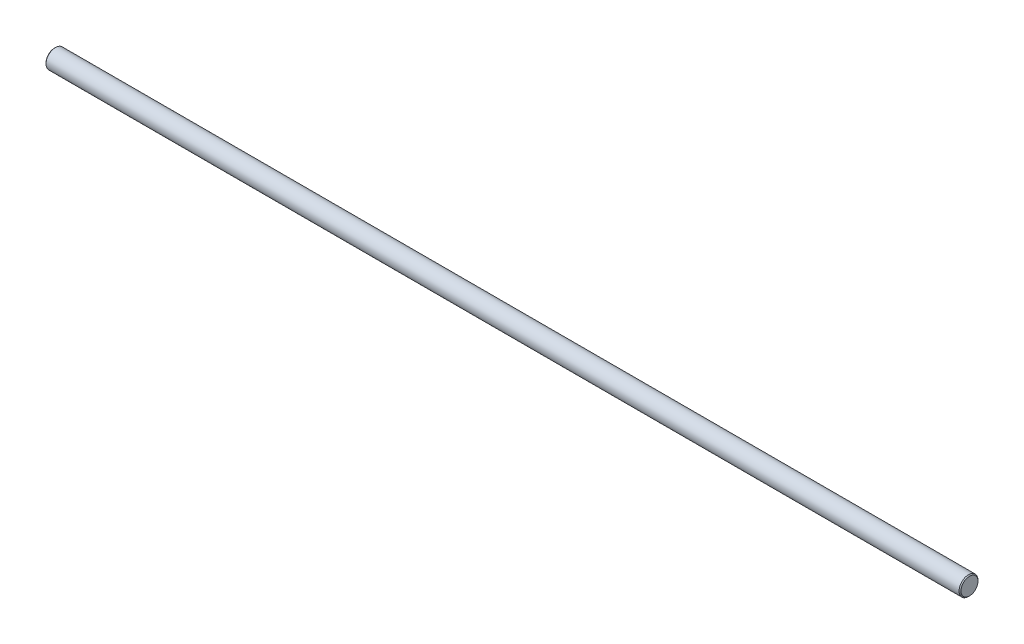
ISO-10303-21;
HEADER;
FILE_DESCRIPTION(('STEP AP214'),'2;1');
FILE_NAME('part.step','',(''),(''),'','','');
FILE_SCHEMA(('AUTOMOTIVE_DESIGN { 1 0 10303 214 1 1 1 1 }'));
ENDSEC;
DATA;
#1=APPLICATION_CONTEXT('core data for automotive mechanical design processes');
#2=APPLICATION_PROTOCOL_DEFINITION('international standard','automotive_design',2000,#1);
#3=PRODUCT_CONTEXT('',#1,'mechanical');
#4=PRODUCT('Part','Part','',(#3));
#5=PRODUCT_RELATED_PRODUCT_CATEGORY('part','',(#4));
#6=PRODUCT_DEFINITION_FORMATION('','',#4);
#7=PRODUCT_DEFINITION_CONTEXT('part definition',#1,'design');
#8=PRODUCT_DEFINITION('design','',#6,#7);
#9=PRODUCT_DEFINITION_SHAPE('','',#8);
#10=(LENGTH_UNIT() NAMED_UNIT(*) SI_UNIT(.MILLI.,.METRE.));
#11=(NAMED_UNIT(*) PLANE_ANGLE_UNIT() SI_UNIT($,.RADIAN.));
#12=(NAMED_UNIT(*) SI_UNIT($,.STERADIAN.) SOLID_ANGLE_UNIT());
#13=UNCERTAINTY_MEASURE_WITH_UNIT(LENGTH_MEASURE(1.E-05),#10,'distance_accuracy_value','');
#14=(GEOMETRIC_REPRESENTATION_CONTEXT(3) GLOBAL_UNCERTAINTY_ASSIGNED_CONTEXT((#13)) GLOBAL_UNIT_ASSIGNED_CONTEXT((#10,
#11,#12)) REPRESENTATION_CONTEXT('',''));
#15=CARTESIAN_POINT('',(0.,0.,0.));
#16=DIRECTION('',(0.,0.,1.));
#17=DIRECTION('',(1.,0.,0.));
#18=AXIS2_PLACEMENT_3D('',#15,#16,#17);
#19=CARTESIAN_POINT('',(0.,0.,0.));
#20=DIRECTION('',(1.,0.,0.));
#21=DIRECTION('',(0.,1.,0.));
#22=AXIS2_PLACEMENT_3D('',#19,#20,#21);
#23=PLANE('',#22);
#24=CARTESIAN_POINT('',(0.,0.,0.));
#25=DIRECTION('',(-1.,0.,0.));
#26=DIRECTION('',(0.,-1.,0.));
#27=AXIS2_PLACEMENT_3D('',#24,#25,#26);
#28=CIRCLE('',#27,4.5);
#29=CARTESIAN_POINT('',(0.,-4.5,0.));
#30=VERTEX_POINT('',#29);
#31=EDGE_CURVE('E10',#30,#30,#28,.T.);
#32=ORIENTED_EDGE('',*,*,#31,.T.);
#33=EDGE_LOOP('',(#32));
#34=FACE_BOUND('',#33,.T.);
#35=ADVANCED_FACE('F31',(#34),#23,.F.);
#36=CARTESIAN_POINT('',(0.5,0.,0.));
#37=DIRECTION('',(1.,0.,0.));
#38=DIRECTION('',(0.,1.,0.));
#39=AXIS2_PLACEMENT_3D('',#36,#37,#38);
#40=CONICAL_SURFACE('',#39,5.,0.785398163397447);
#41=ORIENTED_EDGE('',*,*,#31,.F.);
#42=EDGE_LOOP('',(#41));
#43=FACE_BOUND('',#42,.T.);
#44=CARTESIAN_POINT('',(0.5,0.,0.));
#45=DIRECTION('',(-1.,0.,0.));
#46=DIRECTION('',(0.,-1.,0.));
#47=AXIS2_PLACEMENT_3D('',#44,#45,#46);
#48=CIRCLE('',#47,5.);
#49=CARTESIAN_POINT('',(0.5,-5.,0.));
#50=VERTEX_POINT('',#49);
#51=EDGE_CURVE('E37',#50,#50,#48,.T.);
#52=ORIENTED_EDGE('',*,*,#51,.T.);
#53=EDGE_LOOP('',(#52));
#54=FACE_BOUND('',#53,.T.);
#55=ADVANCED_FACE('F63',(#43,#54),#40,.T.);
#56=CARTESIAN_POINT('',(483.,0.,0.));
#57=DIRECTION('',(-1.,0.,0.));
#58=DIRECTION('',(0.,-1.,0.));
#59=AXIS2_PLACEMENT_3D('',#56,#57,#58);
#60=CYLINDRICAL_SURFACE('',#59,5.00000000000003);
#61=ORIENTED_EDGE('',*,*,#51,.F.);
#62=EDGE_LOOP('',(#61));
#63=FACE_BOUND('',#62,.T.);
#64=CARTESIAN_POINT('',(482.5,0.,0.));
#65=DIRECTION('',(-1.,0.,0.));
#66=DIRECTION('',(0.,-1.,0.));
#67=AXIS2_PLACEMENT_3D('',#64,#65,#66);
#68=CIRCLE('',#67,5.00000000000006);
#69=CARTESIAN_POINT('',(482.5,-5.00000000000006,0.));
#70=VERTEX_POINT('',#69);
#71=EDGE_CURVE('E41',#70,#70,#68,.T.);
#72=ORIENTED_EDGE('',*,*,#71,.T.);
#73=EDGE_LOOP('',(#72));
#74=FACE_BOUND('',#73,.T.);
#75=ADVANCED_FACE('F59',(#63,#74),#60,.T.);
#76=CARTESIAN_POINT('',(483.,0.,0.));
#77=DIRECTION('',(-1.,0.,0.));
#78=DIRECTION('',(0.,-1.,0.));
#79=AXIS2_PLACEMENT_3D('',#76,#77,#78);
#80=CONICAL_SURFACE('',#79,4.50000000000006,0.785398163397504);
#81=ORIENTED_EDGE('',*,*,#71,.F.);
#82=EDGE_LOOP('',(#81));
#83=FACE_BOUND('',#82,.T.);
#84=CARTESIAN_POINT('',(483.,0.,0.));
#85=DIRECTION('',(-1.,0.,0.));
#86=DIRECTION('',(0.,-1.,0.));
#87=AXIS2_PLACEMENT_3D('',#84,#85,#86);
#88=CIRCLE('',#87,4.50000000000006);
#89=CARTESIAN_POINT('',(483.,-4.50000000000005,0.));
#90=VERTEX_POINT('',#89);
#91=EDGE_CURVE('E45',#90,#90,#88,.T.);
#92=ORIENTED_EDGE('',*,*,#91,.T.);
#93=EDGE_LOOP('',(#92));
#94=FACE_BOUND('',#93,.T.);
#95=ADVANCED_FACE('F51',(#83,#94),#80,.T.);
#96=CARTESIAN_POINT('',(483.,4.50000000000006,0.));
#97=DIRECTION('',(-1.,0.,0.));
#98=DIRECTION('',(0.,-1.,0.));
#99=AXIS2_PLACEMENT_3D('',#96,#97,#98);
#100=PLANE('',#99);
#101=ORIENTED_EDGE('',*,*,#91,.F.);
#102=EDGE_LOOP('',(#101));
#103=FACE_BOUND('',#102,.T.);
#104=ADVANCED_FACE('F53',(#103),#100,.F.);
#105=CLOSED_SHELL('',(#35,#55,#75,#95,#104));
#106=MANIFOLD_SOLID_BREP('B2',#105);
#107=ADVANCED_BREP_SHAPE_REPRESENTATION('',(#18,#106),#14);
#108=SHAPE_DEFINITION_REPRESENTATION(#9,#107);
ENDSEC;
END-ISO-10303-21;
